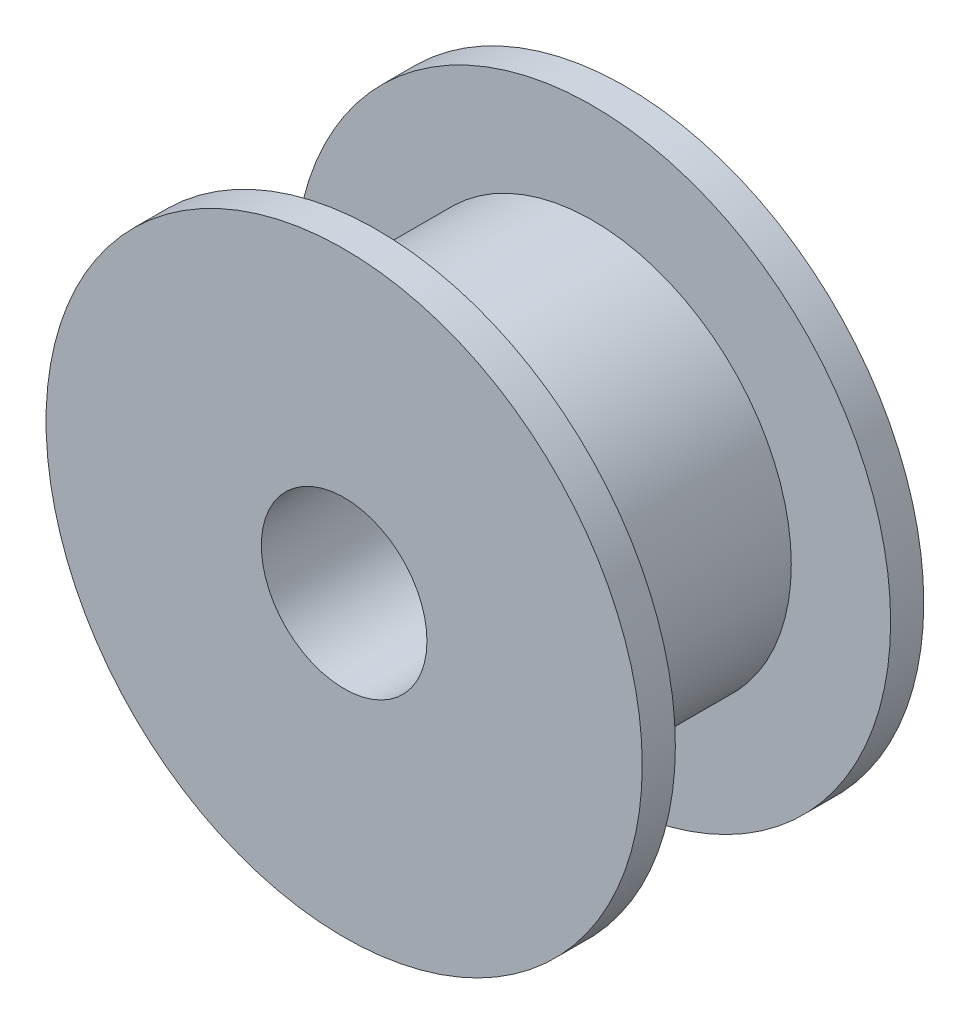
ISO-10303-21;
HEADER;
FILE_DESCRIPTION(('STEP AP214'),'2;1');
FILE_NAME('part.step','',(''),(''),'','','');
FILE_SCHEMA(('AUTOMOTIVE_DESIGN { 1 0 10303 214 1 1 1 1 }'));
ENDSEC;
DATA;
#1=APPLICATION_CONTEXT('core data for automotive mechanical design processes');
#2=APPLICATION_PROTOCOL_DEFINITION('international standard','automotive_design',2000,#1);
#3=PRODUCT_CONTEXT('',#1,'mechanical');
#4=PRODUCT('Part','Part','',(#3));
#5=PRODUCT_RELATED_PRODUCT_CATEGORY('part','',(#4));
#6=PRODUCT_DEFINITION_FORMATION('','',#4);
#7=PRODUCT_DEFINITION_CONTEXT('part definition',#1,'design');
#8=PRODUCT_DEFINITION('design','',#6,#7);
#9=PRODUCT_DEFINITION_SHAPE('','',#8);
#10=(LENGTH_UNIT() NAMED_UNIT(*) SI_UNIT(.MILLI.,.METRE.));
#11=(NAMED_UNIT(*) PLANE_ANGLE_UNIT() SI_UNIT($,.RADIAN.));
#12=(NAMED_UNIT(*) SI_UNIT($,.STERADIAN.) SOLID_ANGLE_UNIT());
#13=UNCERTAINTY_MEASURE_WITH_UNIT(LENGTH_MEASURE(1.E-05),#10,'distance_accuracy_value','');
#14=(GEOMETRIC_REPRESENTATION_CONTEXT(3) GLOBAL_UNCERTAINTY_ASSIGNED_CONTEXT((#13)) GLOBAL_UNIT_ASSIGNED_CONTEXT((#10,
#11,#12)) REPRESENTATION_CONTEXT('',''));
#15=CARTESIAN_POINT('',(0.,0.,0.));
#16=DIRECTION('',(0.,0.,1.));
#17=DIRECTION('',(1.,0.,0.));
#18=AXIS2_PLACEMENT_3D('',#15,#16,#17);
#19=CARTESIAN_POINT('',(0.,0.,1.));
#20=DIRECTION('',(0.,0.,-1.));
#21=DIRECTION('',(-1.,0.,0.));
#22=AXIS2_PLACEMENT_3D('',#19,#20,#21);
#23=CYLINDRICAL_SURFACE('',#22,9.);
#24=CARTESIAN_POINT('',(0.,0.,1.));
#25=DIRECTION('',(0.,0.,1.));
#26=DIRECTION('',(1.,0.,0.));
#27=AXIS2_PLACEMENT_3D('',#24,#25,#26);
#28=CIRCLE('',#27,9.);
#29=CARTESIAN_POINT('',(9.,0.,1.));
#30=VERTEX_POINT('',#29);
#31=EDGE_CURVE('E10',#30,#30,#28,.T.);
#32=ORIENTED_EDGE('',*,*,#31,.F.);
#33=EDGE_LOOP('',(#32));
#34=FACE_BOUND('',#33,.T.);
#35=CARTESIAN_POINT('',(0.,0.,0.));
#36=DIRECTION('',(0.,0.,1.));
#37=DIRECTION('',(1.,0.,0.));
#38=AXIS2_PLACEMENT_3D('',#35,#36,#37);
#39=CIRCLE('',#38,9.);
#40=CARTESIAN_POINT('',(9.,0.,0.));
#41=VERTEX_POINT('',#40);
#42=EDGE_CURVE('E36',#41,#41,#39,.T.);
#43=ORIENTED_EDGE('',*,*,#42,.T.);
#44=EDGE_LOOP('',(#43));
#45=FACE_BOUND('',#44,.T.);
#46=ADVANCED_FACE('F33',(#34,#45),#23,.T.);
#47=CARTESIAN_POINT('',(0.,0.,1.));
#48=DIRECTION('',(0.,0.,1.));
#49=DIRECTION('',(1.,0.,0.));
#50=AXIS2_PLACEMENT_3D('',#47,#48,#49);
#51=PLANE('',#50);
#52=CARTESIAN_POINT('',(0.,0.,1.));
#53=DIRECTION('',(0.,0.,1.));
#54=DIRECTION('',(1.,0.,0.));
#55=AXIS2_PLACEMENT_3D('',#52,#53,#54);
#56=CIRCLE('',#55,6.);
#57=CARTESIAN_POINT('',(6.,0.,1.));
#58=VERTEX_POINT('',#57);
#59=EDGE_CURVE('E45',#58,#58,#56,.T.);
#60=ORIENTED_EDGE('',*,*,#59,.F.);
#61=EDGE_LOOP('',(#60));
#62=FACE_BOUND('',#61,.T.);
#63=ORIENTED_EDGE('',*,*,#31,.T.);
#64=EDGE_LOOP('',(#63));
#65=FACE_BOUND('',#64,.T.);
#66=ADVANCED_FACE('F92',(#62,#65),#51,.T.);
#67=CARTESIAN_POINT('',(0.,0.,0.));
#68=DIRECTION('',(0.,0.,1.));
#69=DIRECTION('',(1.,0.,0.));
#70=AXIS2_PLACEMENT_3D('',#67,#68,#69);
#71=PLANE('',#70);
#72=CARTESIAN_POINT('',(0.,0.,0.));
#73=DIRECTION('',(0.,0.,1.));
#74=DIRECTION('',(1.,0.,0.));
#75=AXIS2_PLACEMENT_3D('',#72,#73,#74);
#76=CIRCLE('',#75,2.5);
#77=CARTESIAN_POINT('',(2.5,0.,0.));
#78=VERTEX_POINT('',#77);
#79=EDGE_CURVE('E54',#78,#78,#76,.T.);
#80=ORIENTED_EDGE('',*,*,#79,.T.);
#81=EDGE_LOOP('',(#80));
#82=FACE_BOUND('',#81,.T.);
#83=ORIENTED_EDGE('',*,*,#42,.F.);
#84=EDGE_LOOP('',(#83));
#85=FACE_BOUND('',#84,.T.);
#86=ADVANCED_FACE('F63',(#82,#85),#71,.F.);
#87=CARTESIAN_POINT('',(0.,0.,7.5));
#88=DIRECTION('',(0.,0.,-1.));
#89=DIRECTION('',(-1.,0.,0.));
#90=AXIS2_PLACEMENT_3D('',#87,#88,#89);
#91=CYLINDRICAL_SURFACE('',#90,6.);
#92=CARTESIAN_POINT('',(0.,0.,7.5));
#93=DIRECTION('',(0.,0.,1.));
#94=DIRECTION('',(1.,0.,0.));
#95=AXIS2_PLACEMENT_3D('',#92,#93,#94);
#96=CIRCLE('',#95,6.);
#97=CARTESIAN_POINT('',(6.,0.,7.5));
#98=VERTEX_POINT('',#97);
#99=EDGE_CURVE('E43',#98,#98,#96,.T.);
#100=ORIENTED_EDGE('',*,*,#99,.F.);
#101=EDGE_LOOP('',(#100));
#102=FACE_BOUND('',#101,.T.);
#103=ORIENTED_EDGE('',*,*,#59,.T.);
#104=EDGE_LOOP('',(#103));
#105=FACE_BOUND('',#104,.T.);
#106=ADVANCED_FACE('F82',(#102,#105),#91,.T.);
#107=CARTESIAN_POINT('',(0.,0.,8.5));
#108=DIRECTION('',(0.,0.,-1.));
#109=DIRECTION('',(-1.,0.,0.));
#110=AXIS2_PLACEMENT_3D('',#107,#108,#109);
#111=CYLINDRICAL_SURFACE('',#110,9.);
#112=CARTESIAN_POINT('',(0.,0.,8.5));
#113=DIRECTION('',(0.,0.,1.));
#114=DIRECTION('',(1.,0.,0.));
#115=AXIS2_PLACEMENT_3D('',#112,#113,#114);
#116=CIRCLE('',#115,9.);
#117=CARTESIAN_POINT('',(9.,0.,8.5));
#118=VERTEX_POINT('',#117);
#119=EDGE_CURVE('E48',#118,#118,#116,.T.);
#120=ORIENTED_EDGE('',*,*,#119,.F.);
#121=EDGE_LOOP('',(#120));
#122=FACE_BOUND('',#121,.T.);
#123=CARTESIAN_POINT('',(0.,0.,7.5));
#124=DIRECTION('',(0.,0.,1.));
#125=DIRECTION('',(1.,0.,0.));
#126=AXIS2_PLACEMENT_3D('',#123,#124,#125);
#127=CIRCLE('',#126,9.);
#128=CARTESIAN_POINT('',(9.,0.,7.5));
#129=VERTEX_POINT('',#128);
#130=EDGE_CURVE('E51',#129,#129,#127,.T.);
#131=ORIENTED_EDGE('',*,*,#130,.T.);
#132=EDGE_LOOP('',(#131));
#133=FACE_BOUND('',#132,.T.);
#134=ADVANCED_FACE('F76',(#122,#133),#111,.T.);
#135=CARTESIAN_POINT('',(0.,0.,8.5));
#136=DIRECTION('',(0.,0.,1.));
#137=DIRECTION('',(1.,0.,0.));
#138=AXIS2_PLACEMENT_3D('',#135,#136,#137);
#139=PLANE('',#138);
#140=CARTESIAN_POINT('',(0.,0.,8.5));
#141=DIRECTION('',(0.,0.,1.));
#142=DIRECTION('',(1.,0.,0.));
#143=AXIS2_PLACEMENT_3D('',#140,#141,#142);
#144=CIRCLE('',#143,2.5);
#145=CARTESIAN_POINT('',(2.5,0.,8.5));
#146=VERTEX_POINT('',#145);
#147=EDGE_CURVE('E57',#146,#146,#144,.T.);
#148=ORIENTED_EDGE('',*,*,#147,.F.);
#149=EDGE_LOOP('',(#148));
#150=FACE_BOUND('',#149,.T.);
#151=ORIENTED_EDGE('',*,*,#119,.T.);
#152=EDGE_LOOP('',(#151));
#153=FACE_BOUND('',#152,.T.);
#154=ADVANCED_FACE('F73',(#150,#153),#139,.T.);
#155=CARTESIAN_POINT('',(0.,0.,7.5));
#156=DIRECTION('',(0.,0.,1.));
#157=DIRECTION('',(1.,0.,0.));
#158=AXIS2_PLACEMENT_3D('',#155,#156,#157);
#159=PLANE('',#158);
#160=ORIENTED_EDGE('',*,*,#99,.T.);
#161=EDGE_LOOP('',(#160));
#162=FACE_BOUND('',#161,.T.);
#163=ORIENTED_EDGE('',*,*,#130,.F.);
#164=EDGE_LOOP('',(#163));
#165=FACE_BOUND('',#164,.T.);
#166=ADVANCED_FACE('F69',(#162,#165),#159,.F.);
#167=CARTESIAN_POINT('',(0.,0.,0.));
#168=DIRECTION('',(0.,0.,1.));
#169=DIRECTION('',(1.,0.,0.));
#170=AXIS2_PLACEMENT_3D('',#167,#168,#169);
#171=CYLINDRICAL_SURFACE('',#170,2.5);
#172=ORIENTED_EDGE('',*,*,#79,.F.);
#173=EDGE_LOOP('',(#172));
#174=FACE_BOUND('',#173,.T.);
#175=ORIENTED_EDGE('',*,*,#147,.T.);
#176=EDGE_LOOP('',(#175));
#177=FACE_BOUND('',#176,.T.);
#178=ADVANCED_FACE('F66',(#174,#177),#171,.F.);
#179=CLOSED_SHELL('',(#46,#66,#86,#106,#134,#154,#166,#178));
#180=MANIFOLD_SOLID_BREP('B2',#179);
#181=ADVANCED_BREP_SHAPE_REPRESENTATION('',(#18,#180),#14);
#182=SHAPE_DEFINITION_REPRESENTATION(#9,#181);
ENDSEC;
END-ISO-10303-21;
